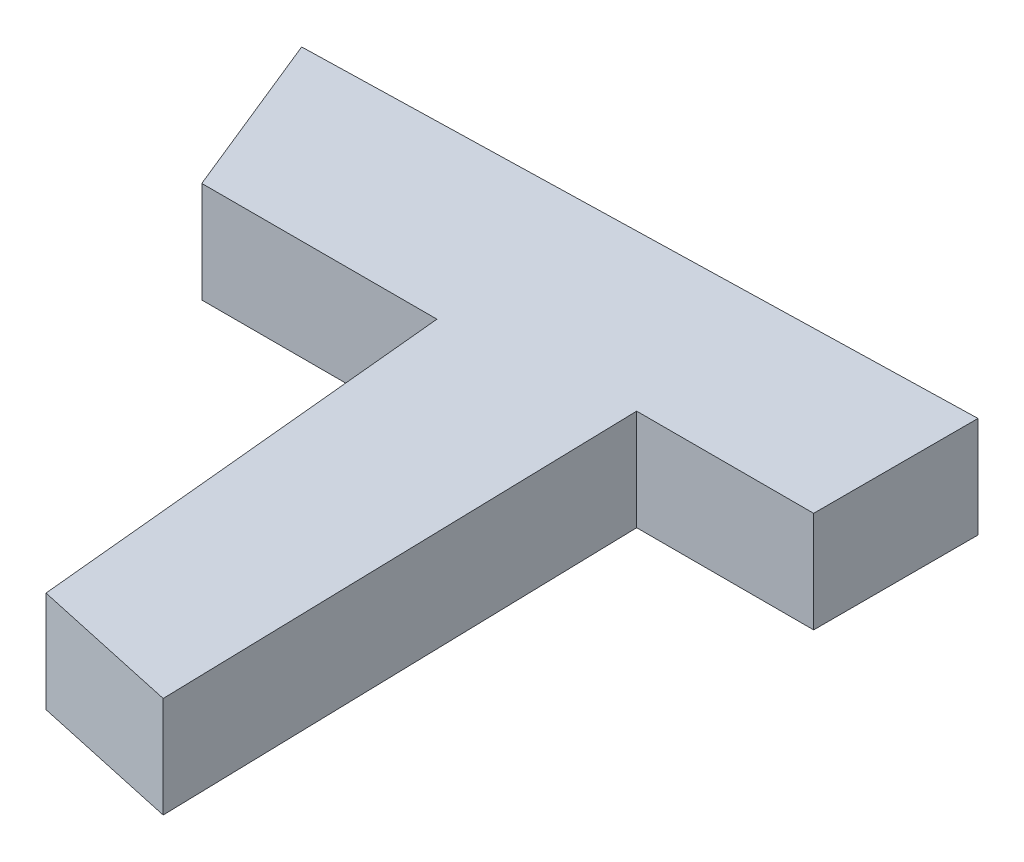
ISO-10303-21;
HEADER;
FILE_DESCRIPTION(('STEP AP214'),'2;1');
FILE_NAME('part.step','',(''),(''),'','','');
FILE_SCHEMA(('AUTOMOTIVE_DESIGN { 1 0 10303 214 1 1 1 1 }'));
ENDSEC;
DATA;
#1=APPLICATION_CONTEXT('core data for automotive mechanical design processes');
#2=APPLICATION_PROTOCOL_DEFINITION('international standard','automotive_design',2000,#1);
#3=PRODUCT_CONTEXT('',#1,'mechanical');
#4=PRODUCT('Part','Part','',(#3));
#5=PRODUCT_RELATED_PRODUCT_CATEGORY('part','',(#4));
#6=PRODUCT_DEFINITION_FORMATION('','',#4);
#7=PRODUCT_DEFINITION_CONTEXT('part definition',#1,'design');
#8=PRODUCT_DEFINITION('design','',#6,#7);
#9=PRODUCT_DEFINITION_SHAPE('','',#8);
#10=(LENGTH_UNIT() NAMED_UNIT(*) SI_UNIT(.MILLI.,.METRE.));
#11=(NAMED_UNIT(*) PLANE_ANGLE_UNIT() SI_UNIT($,.RADIAN.));
#12=(NAMED_UNIT(*) SI_UNIT($,.STERADIAN.) SOLID_ANGLE_UNIT());
#13=UNCERTAINTY_MEASURE_WITH_UNIT(LENGTH_MEASURE(1.E-05),#10,'distance_accuracy_value','');
#14=(GEOMETRIC_REPRESENTATION_CONTEXT(3) GLOBAL_UNCERTAINTY_ASSIGNED_CONTEXT((#13)) GLOBAL_UNIT_ASSIGNED_CONTEXT((#10,
#11,#12)) REPRESENTATION_CONTEXT('',''));
#15=CARTESIAN_POINT('',(0.,0.,0.));
#16=DIRECTION('',(0.,0.,1.));
#17=DIRECTION('',(1.,0.,0.));
#18=AXIS2_PLACEMENT_3D('',#15,#16,#17);
#19=CARTESIAN_POINT('',(6.76046797339241,10.,16.6507822307629));
#20=DIRECTION('',(0.926542471355432,0.,-0.376190176339798));
#21=DIRECTION('',(-0.376190176339798,0.,-0.926542471355432));
#22=AXIS2_PLACEMENT_3D('',#19,#20,#21);
#23=PLANE('',#22);
#24=DIRECTION('',(0.376190176339798,0.,0.926542471355432));
#25=VECTOR('',#24,1.);
#26=CARTESIAN_POINT('',(6.76046797339241,0.,16.6507822307629));
#27=LINE('',#26,#25);
#28=CARTESIAN_POINT('',(0.,0.,0.));
#29=VERTEX_POINT('',#28);
#30=CARTESIAN_POINT('',(6.76046797339241,0.,16.6507822307629));
#31=VERTEX_POINT('',#30);
#32=EDGE_CURVE('E129',#29,#31,#27,.T.);
#33=ORIENTED_EDGE('',*,*,#32,.T.);
#34=DIRECTION('',(0.,-1.,0.));
#35=VECTOR('',#34,1.);
#36=CARTESIAN_POINT('',(6.76046797339241,10.,16.6507822307629));
#37=LINE('',#36,#35);
#38=CARTESIAN_POINT('',(6.76046797339241,10.,16.6507822307629));
#39=VERTEX_POINT('',#38);
#40=EDGE_CURVE('E11',#39,#31,#37,.T.);
#41=ORIENTED_EDGE('',*,*,#40,.F.);
#42=DIRECTION('',(0.376190176339798,0.,0.926542471355432));
#43=VECTOR('',#42,1.);
#44=CARTESIAN_POINT('',(6.76046797339241,10.,16.6507822307629));
#45=LINE('',#44,#43);
#46=CARTESIAN_POINT('',(0.,10.,0.));
#47=VERTEX_POINT('',#46);
#48=EDGE_CURVE('E143',#47,#39,#45,.T.);
#49=ORIENTED_EDGE('',*,*,#48,.F.);
#50=DIRECTION('',(0.,-1.,0.));
#51=VECTOR('',#50,1.);
#52=CARTESIAN_POINT('',(0.,10.,0.));
#53=LINE('',#52,#51);
#54=EDGE_CURVE('E125',#47,#29,#53,.T.);
#55=ORIENTED_EDGE('',*,*,#54,.T.);
#56=EDGE_LOOP('',(#33,#41,#49,#55));
#57=FACE_BOUND('',#56,.T.);
#58=ADVANCED_FACE('F33',(#57),#23,.F.);
#59=CARTESIAN_POINT('',(30.0465243261886,10.,16.6507822307629));
#60=DIRECTION('',(0.,0.,-1.));
#61=DIRECTION('',(-1.,0.,0.));
#62=AXIS2_PLACEMENT_3D('',#59,#60,#61);
#63=PLANE('',#62);
#64=DIRECTION('',(1.,0.,0.));
#65=VECTOR('',#64,1.);
#66=CARTESIAN_POINT('',(30.0465243261886,0.,16.6507822307629));
#67=LINE('',#66,#65);
#68=CARTESIAN_POINT('',(30.0465243261886,0.,16.6507822307629));
#69=VERTEX_POINT('',#68);
#70=EDGE_CURVE('E132',#31,#69,#67,.T.);
#71=ORIENTED_EDGE('',*,*,#70,.T.);
#72=DIRECTION('',(0.,-1.,0.));
#73=VECTOR('',#72,1.);
#74=CARTESIAN_POINT('',(30.0465243261886,10.,16.6507822307629));
#75=LINE('',#74,#73);
#76=CARTESIAN_POINT('',(30.0465243261886,10.,16.6507822307629));
#77=VERTEX_POINT('',#76);
#78=EDGE_CURVE('E41',#77,#69,#75,.T.);
#79=ORIENTED_EDGE('',*,*,#78,.F.);
#80=DIRECTION('',(1.,0.,0.));
#81=VECTOR('',#80,1.);
#82=CARTESIAN_POINT('',(30.0465243261886,10.,16.6507822307629));
#83=LINE('',#82,#81);
#84=EDGE_CURVE('E92',#39,#77,#83,.T.);
#85=ORIENTED_EDGE('',*,*,#84,.F.);
#86=ORIENTED_EDGE('',*,*,#40,.T.);
#87=EDGE_LOOP('',(#71,#79,#85,#86));
#88=FACE_BOUND('',#87,.T.);
#89=ADVANCED_FACE('F178',(#88),#63,.F.);
#90=CARTESIAN_POINT('',(34.1775412289679,10.,59.4951495547884));
#91=DIRECTION('',(0.995383836377641,0.,-0.095974050024622));
#92=DIRECTION('',(-0.095974050024622,0.,-0.995383836377641));
#93=AXIS2_PLACEMENT_3D('',#90,#91,#92);
#94=PLANE('',#93);
#95=DIRECTION('',(0.095974050024622,0.,0.995383836377641));
#96=VECTOR('',#95,1.);
#97=CARTESIAN_POINT('',(34.1775412289679,0.,59.4951495547884));
#98=LINE('',#97,#96);
#99=CARTESIAN_POINT('',(34.1775412289679,0.,59.4951495547884));
#100=VERTEX_POINT('',#99);
#101=EDGE_CURVE('E134',#69,#100,#98,.T.);
#102=ORIENTED_EDGE('',*,*,#101,.T.);
#103=DIRECTION('',(0.,-1.,0.));
#104=VECTOR('',#103,1.);
#105=CARTESIAN_POINT('',(34.1775412289679,10.,59.4951495547884));
#106=LINE('',#105,#104);
#107=CARTESIAN_POINT('',(34.1775412289679,10.,59.4951495547884));
#108=VERTEX_POINT('',#107);
#109=EDGE_CURVE('E150',#108,#100,#106,.T.);
#110=ORIENTED_EDGE('',*,*,#109,.F.);
#111=DIRECTION('',(0.095974050024622,0.,0.995383836377641));
#112=VECTOR('',#111,1.);
#113=CARTESIAN_POINT('',(34.1775412289679,10.,59.4951495547884));
#114=LINE('',#113,#112);
#115=EDGE_CURVE('E158',#77,#108,#114,.T.);
#116=ORIENTED_EDGE('',*,*,#115,.F.);
#117=ORIENTED_EDGE('',*,*,#78,.T.);
#118=EDGE_LOOP('',(#102,#110,#116,#117));
#119=FACE_BOUND('',#118,.T.);
#120=ADVANCED_FACE('F156',(#119),#94,.F.);
#121=CARTESIAN_POINT('',(49.0216516533484,10.,62.7359441962506));
#122=DIRECTION('',(0.213297728292446,0.,-0.976987246132355));
#123=DIRECTION('',(-0.976987246132355,0.,-0.213297728292446));
#124=AXIS2_PLACEMENT_3D('',#121,#122,#123);
#125=PLANE('',#124);
#126=DIRECTION('',(0.976987246132354,0.,0.213297728292446));
#127=VECTOR('',#126,1.);
#128=CARTESIAN_POINT('',(49.0216516533484,0.,62.7359441962506));
#129=LINE('',#128,#127);
#130=CARTESIAN_POINT('',(49.0216516533484,0.,62.7359441962506));
#131=VERTEX_POINT('',#130);
#132=EDGE_CURVE('E136',#100,#131,#129,.T.);
#133=ORIENTED_EDGE('',*,*,#132,.T.);
#134=DIRECTION('',(0.,-1.,0.));
#135=VECTOR('',#134,1.);
#136=CARTESIAN_POINT('',(49.0216516533484,10.,62.7359441962506));
#137=LINE('',#136,#135);
#138=CARTESIAN_POINT('',(49.0216516533484,10.,62.7359441962506));
#139=VERTEX_POINT('',#138);
#140=EDGE_CURVE('E147',#139,#131,#137,.T.);
#141=ORIENTED_EDGE('',*,*,#140,.F.);
#142=DIRECTION('',(0.976987246132354,0.,0.213297728292446));
#143=VECTOR('',#142,1.);
#144=CARTESIAN_POINT('',(49.0216516533484,10.,62.7359441962506));
#145=LINE('',#144,#143);
#146=EDGE_CURVE('E170',#108,#139,#145,.T.);
#147=ORIENTED_EDGE('',*,*,#146,.F.);
#148=ORIENTED_EDGE('',*,*,#109,.T.);
#149=EDGE_LOOP('',(#133,#141,#147,#148));
#150=FACE_BOUND('',#149,.T.);
#151=ADVANCED_FACE('F166',(#150),#125,.F.);
#152=CARTESIAN_POINT('',(47.8240512191835,10.,14.6476806090169));
#153=DIRECTION('',(-0.999690034226347,0.,0.024896495105254));
#154=DIRECTION('',(0.024896495105254,0.,0.999690034226347));
#155=AXIS2_PLACEMENT_3D('',#152,#153,#154);
#156=PLANE('',#155);
#157=DIRECTION('',(-0.024896495105254,0.,-0.999690034226347));
#158=VECTOR('',#157,1.);
#159=CARTESIAN_POINT('',(47.8240512191835,0.,14.6476806090169));
#160=LINE('',#159,#158);
#161=CARTESIAN_POINT('',(47.8240512191835,0.,14.6476806090169));
#162=VERTEX_POINT('',#161);
#163=EDGE_CURVE('E138',#131,#162,#160,.T.);
#164=ORIENTED_EDGE('',*,*,#163,.T.);
#165=DIRECTION('',(0.,-1.,0.));
#166=VECTOR('',#165,1.);
#167=CARTESIAN_POINT('',(47.8240512191835,10.,14.6476806090169));
#168=LINE('',#167,#166);
#169=CARTESIAN_POINT('',(47.8240512191835,10.,14.6476806090169));
#170=VERTEX_POINT('',#169);
#171=EDGE_CURVE('E120',#170,#162,#168,.T.);
#172=ORIENTED_EDGE('',*,*,#171,.F.);
#173=DIRECTION('',(-0.024896495105254,0.,-0.999690034226347));
#174=VECTOR('',#173,1.);
#175=CARTESIAN_POINT('',(47.8240512191835,10.,14.6476806090169));
#176=LINE('',#175,#174);
#177=EDGE_CURVE('E111',#139,#170,#176,.T.);
#178=ORIENTED_EDGE('',*,*,#177,.F.);
#179=ORIENTED_EDGE('',*,*,#140,.T.);
#180=EDGE_LOOP('',(#164,#172,#178,#179));
#181=FACE_BOUND('',#180,.T.);
#182=ADVANCED_FACE('F169',(#181),#156,.F.);
#183=CARTESIAN_POINT('',(65.3511904094602,10.,14.6476806090169));
#184=DIRECTION('',(0.,0.,-1.));
#185=DIRECTION('',(-1.,0.,0.));
#186=AXIS2_PLACEMENT_3D('',#183,#184,#185);
#187=PLANE('',#186);
#188=DIRECTION('',(1.,0.,0.));
#189=VECTOR('',#188,1.);
#190=CARTESIAN_POINT('',(65.3511904094602,0.,14.6476806090169));
#191=LINE('',#190,#189);
#192=CARTESIAN_POINT('',(65.3511904094602,0.,14.6476806090169));
#193=VERTEX_POINT('',#192);
#194=EDGE_CURVE('E119',#162,#193,#191,.T.);
#195=ORIENTED_EDGE('',*,*,#194,.T.);
#196=DIRECTION('',(0.,-1.,0.));
#197=VECTOR('',#196,1.);
#198=CARTESIAN_POINT('',(65.3511904094602,10.,14.6476806090169));
#199=LINE('',#198,#197);
#200=CARTESIAN_POINT('',(65.3511904094602,10.,14.6476806090169));
#201=VERTEX_POINT('',#200);
#202=EDGE_CURVE('E116',#201,#193,#199,.T.);
#203=ORIENTED_EDGE('',*,*,#202,.F.);
#204=DIRECTION('',(1.,0.,0.));
#205=VECTOR('',#204,1.);
#206=CARTESIAN_POINT('',(65.3511904094602,10.,14.6476806090169));
#207=LINE('',#206,#205);
#208=EDGE_CURVE('E105',#170,#201,#207,.T.);
#209=ORIENTED_EDGE('',*,*,#208,.F.);
#210=ORIENTED_EDGE('',*,*,#171,.T.);
#211=EDGE_LOOP('',(#195,#203,#209,#210));
#212=FACE_BOUND('',#211,.T.);
#213=ADVANCED_FACE('F117',(#212),#187,.F.);
#214=CARTESIAN_POINT('',(65.3511904094602,10.,-1.62752006766856));
#215=DIRECTION('',(-1.,0.,0.));
#216=DIRECTION('',(0.,0.,1.));
#217=AXIS2_PLACEMENT_3D('',#214,#215,#216);
#218=PLANE('',#217);
#219=DIRECTION('',(0.,0.,-1.));
#220=VECTOR('',#219,1.);
#221=CARTESIAN_POINT('',(65.3511904094602,0.,-1.62752006766856));
#222=LINE('',#221,#220);
#223=CARTESIAN_POINT('',(65.3511904094602,0.,-1.62752006766856));
#224=VERTEX_POINT('',#223);
#225=EDGE_CURVE('E78',#193,#224,#222,.T.);
#226=ORIENTED_EDGE('',*,*,#225,.T.);
#227=DIRECTION('',(0.,-1.,0.));
#228=VECTOR('',#227,1.);
#229=CARTESIAN_POINT('',(65.3511904094602,10.,-1.62752006766856));
#230=LINE('',#229,#228);
#231=CARTESIAN_POINT('',(65.3511904094602,10.,-1.62752006766856));
#232=VERTEX_POINT('',#231);
#233=EDGE_CURVE('E121',#232,#224,#230,.T.);
#234=ORIENTED_EDGE('',*,*,#233,.F.);
#235=DIRECTION('',(0.,0.,-1.));
#236=VECTOR('',#235,1.);
#237=CARTESIAN_POINT('',(65.3511904094602,10.,-1.62752006766856));
#238=LINE('',#237,#236);
#239=EDGE_CURVE('E109',#201,#232,#238,.T.);
#240=ORIENTED_EDGE('',*,*,#239,.F.);
#241=ORIENTED_EDGE('',*,*,#202,.T.);
#242=EDGE_LOOP('',(#226,#234,#240,#241));
#243=FACE_BOUND('',#242,.T.);
#244=ADVANCED_FACE('F123',(#243),#218,.F.);
#245=CARTESIAN_POINT('',(0.,10.,0.));
#246=DIRECTION('',(0.024896495105254,0.,0.999690034226347));
#247=DIRECTION('',(0.999690034226347,0.,-0.024896495105254));
#248=AXIS2_PLACEMENT_3D('',#245,#246,#247);
#249=PLANE('',#248);
#250=DIRECTION('',(-0.999690034226347,0.,0.024896495105254));
#251=VECTOR('',#250,1.);
#252=CARTESIAN_POINT('',(0.,0.,0.));
#253=LINE('',#252,#251);
#254=EDGE_CURVE('E84',#224,#29,#253,.T.);
#255=ORIENTED_EDGE('',*,*,#254,.T.);
#256=ORIENTED_EDGE('',*,*,#54,.F.);
#257=DIRECTION('',(-0.999690034226347,0.,0.024896495105254));
#258=VECTOR('',#257,1.);
#259=CARTESIAN_POINT('',(0.,10.,0.));
#260=LINE('',#259,#258);
#261=EDGE_CURVE('E49',#232,#47,#260,.T.);
#262=ORIENTED_EDGE('',*,*,#261,.F.);
#263=ORIENTED_EDGE('',*,*,#233,.T.);
#264=EDGE_LOOP('',(#255,#256,#262,#263));
#265=FACE_BOUND('',#264,.T.);
#266=ADVANCED_FACE('F194',(#265),#249,.F.);
#267=CARTESIAN_POINT('',(0.,10.,0.));
#268=DIRECTION('',(0.,-1.,0.));
#269=DIRECTION('',(0.,0.,-1.));
#270=AXIS2_PLACEMENT_3D('',#267,#268,#269);
#271=PLANE('',#270);
#272=ORIENTED_EDGE('',*,*,#48,.T.);
#273=ORIENTED_EDGE('',*,*,#84,.T.);
#274=ORIENTED_EDGE('',*,*,#115,.T.);
#275=ORIENTED_EDGE('',*,*,#146,.T.);
#276=ORIENTED_EDGE('',*,*,#177,.T.);
#277=ORIENTED_EDGE('',*,*,#208,.T.);
#278=ORIENTED_EDGE('',*,*,#239,.T.);
#279=ORIENTED_EDGE('',*,*,#261,.T.);
#280=EDGE_LOOP('',(#272,#273,#274,#275,#276,#277,#278,#279));
#281=FACE_BOUND('',#280,.T.);
#282=ADVANCED_FACE('F107',(#281),#271,.F.);
#283=CARTESIAN_POINT('',(0.,0.,0.));
#284=DIRECTION('',(0.,-1.,0.));
#285=DIRECTION('',(0.,0.,-1.));
#286=AXIS2_PLACEMENT_3D('',#283,#284,#285);
#287=PLANE('',#286);
#288=ORIENTED_EDGE('',*,*,#32,.F.);
#289=ORIENTED_EDGE('',*,*,#254,.F.);
#290=ORIENTED_EDGE('',*,*,#225,.F.);
#291=ORIENTED_EDGE('',*,*,#194,.F.);
#292=ORIENTED_EDGE('',*,*,#163,.F.);
#293=ORIENTED_EDGE('',*,*,#132,.F.);
#294=ORIENTED_EDGE('',*,*,#101,.F.);
#295=ORIENTED_EDGE('',*,*,#70,.F.);
#296=EDGE_LOOP('',(#288,#289,#290,#291,#292,#293,#294,#295));
#297=FACE_BOUND('',#296,.T.);
#298=ADVANCED_FACE('F162',(#297),#287,.T.);
#299=CLOSED_SHELL('',(#58,#89,#120,#151,#182,#213,#244,#266,#282,#298));
#300=MANIFOLD_SOLID_BREP('B2',#299);
#301=ADVANCED_BREP_SHAPE_REPRESENTATION('',(#18,#300),#14);
#302=SHAPE_DEFINITION_REPRESENTATION(#9,#301);
ENDSEC;
END-ISO-10303-21;
